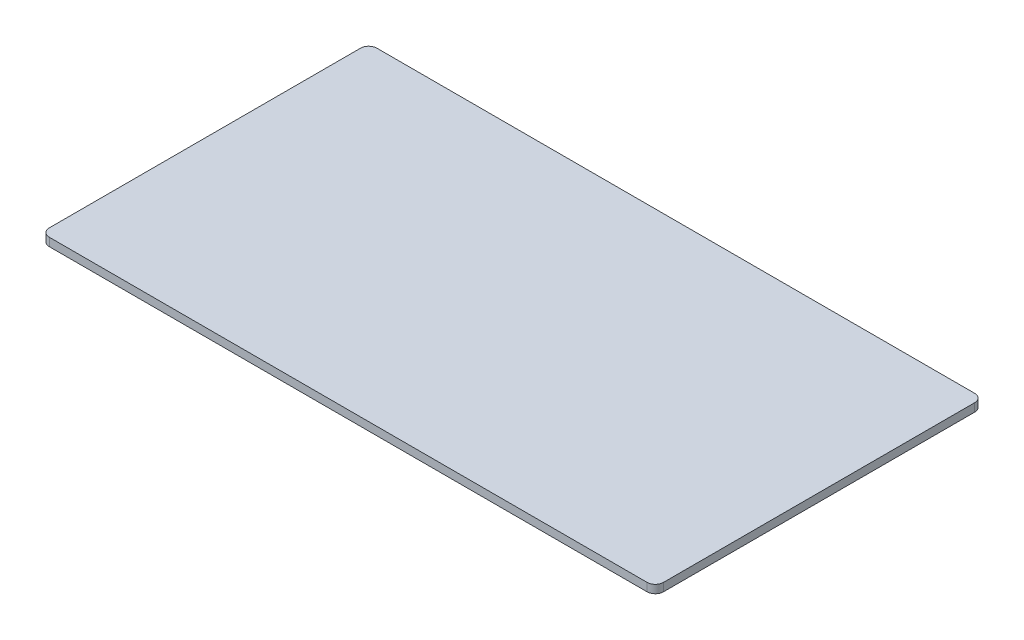
ISO-10303-21;
HEADER;
FILE_DESCRIPTION(('STEP AP214'),'2;1');
FILE_NAME('part.step','',(''),(''),'','','');
FILE_SCHEMA(('AUTOMOTIVE_DESIGN { 1 0 10303 214 1 1 1 1 }'));
ENDSEC;
DATA;
#1=APPLICATION_CONTEXT('core data for automotive mechanical design processes');
#2=APPLICATION_PROTOCOL_DEFINITION('international standard','automotive_design',2000,#1);
#3=PRODUCT_CONTEXT('',#1,'mechanical');
#4=PRODUCT('Part','Part','',(#3));
#5=PRODUCT_RELATED_PRODUCT_CATEGORY('part','',(#4));
#6=PRODUCT_DEFINITION_FORMATION('','',#4);
#7=PRODUCT_DEFINITION_CONTEXT('part definition',#1,'design');
#8=PRODUCT_DEFINITION('design','',#6,#7);
#9=PRODUCT_DEFINITION_SHAPE('','',#8);
#10=(LENGTH_UNIT() NAMED_UNIT(*) SI_UNIT(.MILLI.,.METRE.));
#11=(NAMED_UNIT(*) PLANE_ANGLE_UNIT() SI_UNIT($,.RADIAN.));
#12=(NAMED_UNIT(*) SI_UNIT($,.STERADIAN.) SOLID_ANGLE_UNIT());
#13=UNCERTAINTY_MEASURE_WITH_UNIT(LENGTH_MEASURE(1.E-05),#10,'distance_accuracy_value','');
#14=(GEOMETRIC_REPRESENTATION_CONTEXT(3) GLOBAL_UNCERTAINTY_ASSIGNED_CONTEXT((#13)) GLOBAL_UNIT_ASSIGNED_CONTEXT((#10,
#11,#12)) REPRESENTATION_CONTEXT('',''));
#15=CARTESIAN_POINT('',(0.,0.,0.));
#16=DIRECTION('',(0.,0.,1.));
#17=DIRECTION('',(1.,0.,0.));
#18=AXIS2_PLACEMENT_3D('',#15,#16,#17);
#19=CARTESIAN_POINT('',(750.,10.,-400.));
#20=DIRECTION('',(-1.,0.,0.));
#21=DIRECTION('',(0.,0.,1.));
#22=AXIS2_PLACEMENT_3D('',#19,#20,#21);
#23=PLANE('',#22);
#24=DIRECTION('',(0.,0.,-1.));
#25=VECTOR('',#24,1.);
#26=CARTESIAN_POINT('',(750.,10.,-400.));
#27=LINE('',#26,#25);
#28=CARTESIAN_POINT('',(750.,10.,380.));
#29=VERTEX_POINT('',#28);
#30=CARTESIAN_POINT('',(750.,10.,-380.));
#31=VERTEX_POINT('',#30);
#32=EDGE_CURVE('E126',#29,#31,#27,.T.);
#33=ORIENTED_EDGE('',*,*,#32,.F.);
#34=DIRECTION('',(0.,-1.,0.));
#35=VECTOR('',#34,1.);
#36=CARTESIAN_POINT('',(750.,10.,380.));
#37=LINE('',#36,#35);
#38=CARTESIAN_POINT('',(750.,-10.,380.));
#39=VERTEX_POINT('',#38);
#40=EDGE_CURVE('E111',#29,#39,#37,.T.);
#41=ORIENTED_EDGE('',*,*,#40,.T.);
#42=DIRECTION('',(0.,0.,-1.));
#43=VECTOR('',#42,1.);
#44=CARTESIAN_POINT('',(750.,-10.,-400.));
#45=LINE('',#44,#43);
#46=CARTESIAN_POINT('',(750.,-10.,-380.));
#47=VERTEX_POINT('',#46);
#48=EDGE_CURVE('E123',#39,#47,#45,.T.);
#49=ORIENTED_EDGE('',*,*,#48,.T.);
#50=DIRECTION('',(0.,-1.,0.));
#51=VECTOR('',#50,1.);
#52=CARTESIAN_POINT('',(750.,10.,-380.));
#53=LINE('',#52,#51);
#54=EDGE_CURVE('E128',#47,#31,#53,.F.);
#55=ORIENTED_EDGE('',*,*,#54,.T.);
#56=EDGE_LOOP('',(#33,#41,#49,#55));
#57=FACE_BOUND('',#56,.T.);
#58=ADVANCED_FACE('F41',(#57),#23,.F.);
#59=CARTESIAN_POINT('',(-750.,10.,-400.));
#60=DIRECTION('',(0.,0.,1.));
#61=DIRECTION('',(1.,0.,0.));
#62=AXIS2_PLACEMENT_3D('',#59,#60,#61);
#63=PLANE('',#62);
#64=DIRECTION('',(-1.,0.,0.));
#65=VECTOR('',#64,1.);
#66=CARTESIAN_POINT('',(-750.,10.,-400.));
#67=LINE('',#66,#65);
#68=CARTESIAN_POINT('',(730.,10.,-400.));
#69=VERTEX_POINT('',#68);
#70=CARTESIAN_POINT('',(-730.,10.,-400.));
#71=VERTEX_POINT('',#70);
#72=EDGE_CURVE('E168',#69,#71,#67,.T.);
#73=ORIENTED_EDGE('',*,*,#72,.F.);
#74=DIRECTION('',(0.,-1.,0.));
#75=VECTOR('',#74,1.);
#76=CARTESIAN_POINT('',(730.,10.,-400.));
#77=LINE('',#76,#75);
#78=CARTESIAN_POINT('',(730.,-10.,-400.));
#79=VERTEX_POINT('',#78);
#80=EDGE_CURVE('E161',#69,#79,#77,.T.);
#81=ORIENTED_EDGE('',*,*,#80,.T.);
#82=DIRECTION('',(-1.,0.,0.));
#83=VECTOR('',#82,1.);
#84=CARTESIAN_POINT('',(-750.,-10.,-400.));
#85=LINE('',#84,#83);
#86=CARTESIAN_POINT('',(-730.,-10.,-400.));
#87=VERTEX_POINT('',#86);
#88=EDGE_CURVE('E132',#79,#87,#85,.T.);
#89=ORIENTED_EDGE('',*,*,#88,.T.);
#90=DIRECTION('',(0.,-1.,0.));
#91=VECTOR('',#90,1.);
#92=CARTESIAN_POINT('',(-730.,10.,-400.));
#93=LINE('',#92,#91);
#94=EDGE_CURVE('E159',#87,#71,#93,.F.);
#95=ORIENTED_EDGE('',*,*,#94,.T.);
#96=EDGE_LOOP('',(#73,#81,#89,#95));
#97=FACE_BOUND('',#96,.T.);
#98=ADVANCED_FACE('F166',(#97),#63,.F.);
#99=CARTESIAN_POINT('',(-750.,10.,-400.));
#100=DIRECTION('',(1.,0.,0.));
#101=DIRECTION('',(0.,0.,-1.));
#102=AXIS2_PLACEMENT_3D('',#99,#100,#101);
#103=PLANE('',#102);
#104=DIRECTION('',(0.,0.,1.));
#105=VECTOR('',#104,1.);
#106=CARTESIAN_POINT('',(-750.,10.,-400.));
#107=LINE('',#106,#105);
#108=CARTESIAN_POINT('',(-750.,10.,-380.));
#109=VERTEX_POINT('',#108);
#110=CARTESIAN_POINT('',(-749.999999999999,10.,380.));
#111=VERTEX_POINT('',#110);
#112=EDGE_CURVE('E176',#109,#111,#107,.T.);
#113=ORIENTED_EDGE('',*,*,#112,.F.);
#114=DIRECTION('',(0.,-1.,0.));
#115=VECTOR('',#114,1.);
#116=CARTESIAN_POINT('',(-750.,10.,-380.));
#117=LINE('',#116,#115);
#118=CARTESIAN_POINT('',(-750.,-10.,-380.));
#119=VERTEX_POINT('',#118);
#120=EDGE_CURVE('E11',#109,#119,#117,.T.);
#121=ORIENTED_EDGE('',*,*,#120,.T.);
#122=DIRECTION('',(0.,0.,1.));
#123=VECTOR('',#122,1.);
#124=CARTESIAN_POINT('',(-750.,-10.,-400.));
#125=LINE('',#124,#123);
#126=CARTESIAN_POINT('',(-749.999999999999,-10.,380.));
#127=VERTEX_POINT('',#126);
#128=EDGE_CURVE('E135',#119,#127,#125,.T.);
#129=ORIENTED_EDGE('',*,*,#128,.T.);
#130=DIRECTION('',(0.,-1.,0.));
#131=VECTOR('',#130,1.);
#132=CARTESIAN_POINT('',(-749.999999999999,10.,380.));
#133=LINE('',#132,#131);
#134=EDGE_CURVE('E49',#127,#111,#133,.F.);
#135=ORIENTED_EDGE('',*,*,#134,.T.);
#136=EDGE_LOOP('',(#113,#121,#129,#135));
#137=FACE_BOUND('',#136,.T.);
#138=ADVANCED_FACE('F175',(#137),#103,.F.);
#139=CARTESIAN_POINT('',(-749.999999999999,10.,400.));
#140=DIRECTION('',(0.,0.,-1.));
#141=DIRECTION('',(-1.,0.,0.));
#142=AXIS2_PLACEMENT_3D('',#139,#140,#141);
#143=PLANE('',#142);
#144=DIRECTION('',(1.,0.,0.));
#145=VECTOR('',#144,1.);
#146=CARTESIAN_POINT('',(-749.999999999999,-10.,400.));
#147=LINE('',#146,#145);
#148=CARTESIAN_POINT('',(-729.999999999999,-10.,400.));
#149=VERTEX_POINT('',#148);
#150=CARTESIAN_POINT('',(730.000000000001,-10.,400.));
#151=VERTEX_POINT('',#150);
#152=EDGE_CURVE('E142',#149,#151,#147,.T.);
#153=ORIENTED_EDGE('',*,*,#152,.T.);
#154=DIRECTION('',(0.,-1.,0.));
#155=VECTOR('',#154,1.);
#156=CARTESIAN_POINT('',(730.000000000001,10.,400.));
#157=LINE('',#156,#155);
#158=CARTESIAN_POINT('',(730.000000000001,10.,400.));
#159=VERTEX_POINT('',#158);
#160=EDGE_CURVE('E112',#151,#159,#157,.F.);
#161=ORIENTED_EDGE('',*,*,#160,.T.);
#162=DIRECTION('',(1.,0.,0.));
#163=VECTOR('',#162,1.);
#164=CARTESIAN_POINT('',(-749.999999999999,10.,400.));
#165=LINE('',#164,#163);
#166=CARTESIAN_POINT('',(-729.999999999999,10.,400.));
#167=VERTEX_POINT('',#166);
#168=EDGE_CURVE('E138',#167,#159,#165,.T.);
#169=ORIENTED_EDGE('',*,*,#168,.F.);
#170=DIRECTION('',(0.,-1.,0.));
#171=VECTOR('',#170,1.);
#172=CARTESIAN_POINT('',(-729.999999999999,10.,400.));
#173=LINE('',#172,#171);
#174=EDGE_CURVE('E117',#167,#149,#173,.T.);
#175=ORIENTED_EDGE('',*,*,#174,.T.);
#176=EDGE_LOOP('',(#153,#161,#169,#175));
#177=FACE_BOUND('',#176,.T.);
#178=ADVANCED_FACE('F199',(#177),#143,.F.);
#179=CARTESIAN_POINT('',(0.,10.,0.));
#180=DIRECTION('',(0.,1.,0.));
#181=DIRECTION('',(0.,0.,1.));
#182=AXIS2_PLACEMENT_3D('',#179,#180,#181);
#183=PLANE('',#182);
#184=ORIENTED_EDGE('',*,*,#168,.T.);
#185=CARTESIAN_POINT('',(730.,10.,380.));
#186=DIRECTION('',(0.,1.,0.));
#187=DIRECTION('',(0.,0.,1.));
#188=AXIS2_PLACEMENT_3D('',#185,#186,#187);
#189=CIRCLE('',#188,20.);
#190=EDGE_CURVE('E157',#159,#29,#189,.T.);
#191=ORIENTED_EDGE('',*,*,#190,.T.);
#192=ORIENTED_EDGE('',*,*,#32,.T.);
#193=CARTESIAN_POINT('',(730.,10.,-380.));
#194=DIRECTION('',(0.,1.,0.));
#195=DIRECTION('',(0.,0.,1.));
#196=AXIS2_PLACEMENT_3D('',#193,#194,#195);
#197=CIRCLE('',#196,20.);
#198=EDGE_CURVE('E155',#31,#69,#197,.T.);
#199=ORIENTED_EDGE('',*,*,#198,.T.);
#200=ORIENTED_EDGE('',*,*,#72,.T.);
#201=CARTESIAN_POINT('',(-730.,10.,-380.));
#202=DIRECTION('',(0.,1.,0.));
#203=DIRECTION('',(0.,0.,1.));
#204=AXIS2_PLACEMENT_3D('',#201,#202,#203);
#205=CIRCLE('',#204,20.);
#206=EDGE_CURVE('E62',#71,#109,#205,.T.);
#207=ORIENTED_EDGE('',*,*,#206,.T.);
#208=ORIENTED_EDGE('',*,*,#112,.T.);
#209=CARTESIAN_POINT('',(-729.999999999999,10.,380.));
#210=DIRECTION('',(0.,1.,0.));
#211=DIRECTION('',(0.,0.,1.));
#212=AXIS2_PLACEMENT_3D('',#209,#210,#211);
#213=CIRCLE('',#212,20.);
#214=EDGE_CURVE('E152',#111,#167,#213,.T.);
#215=ORIENTED_EDGE('',*,*,#214,.T.);
#216=EDGE_LOOP('',(#184,#191,#192,#199,#200,#207,#208,#215));
#217=FACE_BOUND('',#216,.T.);
#218=ADVANCED_FACE('F181',(#217),#183,.T.);
#219=CARTESIAN_POINT('',(0.,-10.,0.));
#220=DIRECTION('',(0.,1.,0.));
#221=DIRECTION('',(0.,0.,1.));
#222=AXIS2_PLACEMENT_3D('',#219,#220,#221);
#223=PLANE('',#222);
#224=ORIENTED_EDGE('',*,*,#48,.F.);
#225=CARTESIAN_POINT('',(730.,-10.,380.));
#226=DIRECTION('',(0.,1.,0.));
#227=DIRECTION('',(0.,0.,1.));
#228=AXIS2_PLACEMENT_3D('',#225,#226,#227);
#229=CIRCLE('',#228,20.);
#230=EDGE_CURVE('E107',#39,#151,#229,.F.);
#231=ORIENTED_EDGE('',*,*,#230,.T.);
#232=ORIENTED_EDGE('',*,*,#152,.F.);
#233=CARTESIAN_POINT('',(-729.999999999999,-10.,380.));
#234=DIRECTION('',(0.,1.,0.));
#235=DIRECTION('',(0.,0.,1.));
#236=AXIS2_PLACEMENT_3D('',#233,#234,#235);
#237=CIRCLE('',#236,20.);
#238=EDGE_CURVE('E127',#149,#127,#237,.F.);
#239=ORIENTED_EDGE('',*,*,#238,.T.);
#240=ORIENTED_EDGE('',*,*,#128,.F.);
#241=CARTESIAN_POINT('',(-730.,-10.,-380.));
#242=DIRECTION('',(0.,1.,0.));
#243=DIRECTION('',(0.,0.,1.));
#244=AXIS2_PLACEMENT_3D('',#241,#242,#243);
#245=CIRCLE('',#244,20.);
#246=EDGE_CURVE('E146',#119,#87,#245,.F.);
#247=ORIENTED_EDGE('',*,*,#246,.T.);
#248=ORIENTED_EDGE('',*,*,#88,.F.);
#249=CARTESIAN_POINT('',(730.,-10.,-380.));
#250=DIRECTION('',(0.,1.,0.));
#251=DIRECTION('',(0.,0.,1.));
#252=AXIS2_PLACEMENT_3D('',#249,#250,#251);
#253=CIRCLE('',#252,20.);
#254=EDGE_CURVE('E118',#79,#47,#253,.F.);
#255=ORIENTED_EDGE('',*,*,#254,.T.);
#256=EDGE_LOOP('',(#224,#231,#232,#239,#240,#247,#248,#255));
#257=FACE_BOUND('',#256,.T.);
#258=ADVANCED_FACE('F130',(#257),#223,.F.);
#259=CARTESIAN_POINT('',(730.,10.,380.));
#260=DIRECTION('',(0.,-1.,0.));
#261=DIRECTION('',(0.,0.,-1.));
#262=AXIS2_PLACEMENT_3D('',#259,#260,#261);
#263=CYLINDRICAL_SURFACE('',#262,20.);
#264=ORIENTED_EDGE('',*,*,#190,.F.);
#265=ORIENTED_EDGE('',*,*,#160,.F.);
#266=ORIENTED_EDGE('',*,*,#230,.F.);
#267=ORIENTED_EDGE('',*,*,#40,.F.);
#268=EDGE_LOOP('',(#264,#265,#266,#267));
#269=FACE_BOUND('',#268,.T.);
#270=ADVANCED_FACE('F110',(#269),#263,.T.);
#271=CARTESIAN_POINT('',(730.,10.,-380.));
#272=DIRECTION('',(0.,-1.,0.));
#273=DIRECTION('',(0.,0.,-1.));
#274=AXIS2_PLACEMENT_3D('',#271,#272,#273);
#275=CYLINDRICAL_SURFACE('',#274,20.);
#276=ORIENTED_EDGE('',*,*,#198,.F.);
#277=ORIENTED_EDGE('',*,*,#54,.F.);
#278=ORIENTED_EDGE('',*,*,#254,.F.);
#279=ORIENTED_EDGE('',*,*,#80,.F.);
#280=EDGE_LOOP('',(#276,#277,#278,#279));
#281=FACE_BOUND('',#280,.T.);
#282=ADVANCED_FACE('F182',(#281),#275,.T.);
#283=CARTESIAN_POINT('',(-730.,10.,-380.));
#284=DIRECTION('',(0.,-1.,0.));
#285=DIRECTION('',(0.,0.,-1.));
#286=AXIS2_PLACEMENT_3D('',#283,#284,#285);
#287=CYLINDRICAL_SURFACE('',#286,20.);
#288=ORIENTED_EDGE('',*,*,#206,.F.);
#289=ORIENTED_EDGE('',*,*,#94,.F.);
#290=ORIENTED_EDGE('',*,*,#246,.F.);
#291=ORIENTED_EDGE('',*,*,#120,.F.);
#292=EDGE_LOOP('',(#288,#289,#290,#291));
#293=FACE_BOUND('',#292,.T.);
#294=ADVANCED_FACE('F174',(#293),#287,.T.);
#295=CARTESIAN_POINT('',(-729.999999999999,10.,380.));
#296=DIRECTION('',(0.,-1.,0.));
#297=DIRECTION('',(0.,0.,-1.));
#298=AXIS2_PLACEMENT_3D('',#295,#296,#297);
#299=CYLINDRICAL_SURFACE('',#298,20.);
#300=ORIENTED_EDGE('',*,*,#214,.F.);
#301=ORIENTED_EDGE('',*,*,#134,.F.);
#302=ORIENTED_EDGE('',*,*,#238,.F.);
#303=ORIENTED_EDGE('',*,*,#174,.F.);
#304=EDGE_LOOP('',(#300,#301,#302,#303));
#305=FACE_BOUND('',#304,.T.);
#306=ADVANCED_FACE('F43',(#305),#299,.T.);
#307=CLOSED_SHELL('',(#58,#98,#138,#178,#218,#258,#270,#282,#294,#306));
#308=MANIFOLD_SOLID_BREP('B2',#307);
#309=ADVANCED_BREP_SHAPE_REPRESENTATION('',(#18,#308),#14);
#310=SHAPE_DEFINITION_REPRESENTATION(#9,#309);
ENDSEC;
END-ISO-10303-21;
